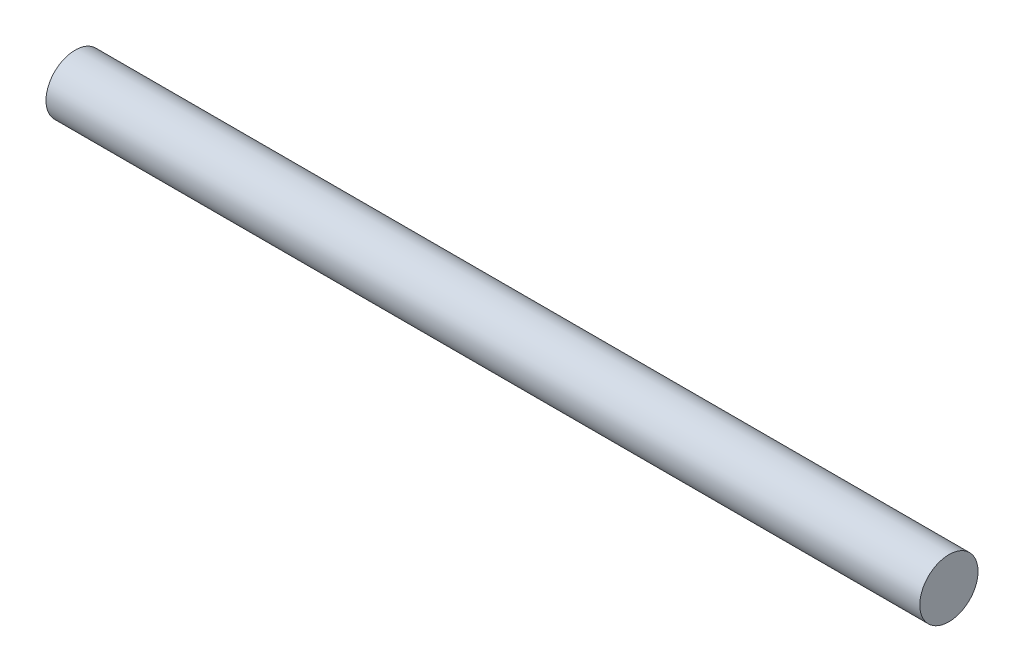
ISO-10303-21;
HEADER;
FILE_DESCRIPTION(('STEP AP214'),'2;1');
FILE_NAME('part.step','',(''),(''),'','','');
FILE_SCHEMA(('AUTOMOTIVE_DESIGN { 1 0 10303 214 1 1 1 1 }'));
ENDSEC;
DATA;
#1=APPLICATION_CONTEXT('core data for automotive mechanical design processes');
#2=APPLICATION_PROTOCOL_DEFINITION('international standard','automotive_design',2000,#1);
#3=PRODUCT_CONTEXT('',#1,'mechanical');
#4=PRODUCT('Part','Part','',(#3));
#5=PRODUCT_RELATED_PRODUCT_CATEGORY('part','',(#4));
#6=PRODUCT_DEFINITION_FORMATION('','',#4);
#7=PRODUCT_DEFINITION_CONTEXT('part definition',#1,'design');
#8=PRODUCT_DEFINITION('design','',#6,#7);
#9=PRODUCT_DEFINITION_SHAPE('','',#8);
#10=(LENGTH_UNIT() NAMED_UNIT(*) SI_UNIT(.MILLI.,.METRE.));
#11=(NAMED_UNIT(*) PLANE_ANGLE_UNIT() SI_UNIT($,.RADIAN.));
#12=(NAMED_UNIT(*) SI_UNIT($,.STERADIAN.) SOLID_ANGLE_UNIT());
#13=UNCERTAINTY_MEASURE_WITH_UNIT(LENGTH_MEASURE(1.E-05),#10,'distance_accuracy_value','');
#14=(GEOMETRIC_REPRESENTATION_CONTEXT(3) GLOBAL_UNCERTAINTY_ASSIGNED_CONTEXT((#13)) GLOBAL_UNIT_ASSIGNED_CONTEXT((#10,
#11,#12)) REPRESENTATION_CONTEXT('',''));
#15=CARTESIAN_POINT('',(0.,0.,0.));
#16=DIRECTION('',(0.,0.,1.));
#17=DIRECTION('',(1.,0.,0.));
#18=AXIS2_PLACEMENT_3D('',#15,#16,#17);
#19=CARTESIAN_POINT('',(0.,0.,0.));
#20=DIRECTION('',(1.,0.,0.));
#21=DIRECTION('',(0.,0.,-1.));
#22=AXIS2_PLACEMENT_3D('',#19,#20,#21);
#23=PLANE('',#22);
#24=CARTESIAN_POINT('',(0.,0.,0.));
#25=DIRECTION('',(-1.,0.,0.));
#26=DIRECTION('',(0.,0.,1.));
#27=AXIS2_PLACEMENT_3D('',#24,#25,#26);
#28=CIRCLE('',#27,1.5);
#29=CARTESIAN_POINT('',(0.,0.,1.5));
#30=VERTEX_POINT('',#29);
#31=EDGE_CURVE('E10',#30,#30,#28,.T.);
#32=ORIENTED_EDGE('',*,*,#31,.T.);
#33=EDGE_LOOP('',(#32));
#34=FACE_BOUND('',#33,.T.);
#35=ADVANCED_FACE('F30',(#34),#23,.F.);
#36=CARTESIAN_POINT('',(0.,0.,0.));
#37=DIRECTION('',(-1.,0.,0.));
#38=DIRECTION('',(0.,0.,1.));
#39=AXIS2_PLACEMENT_3D('',#36,#37,#38);
#40=CYLINDRICAL_SURFACE('',#39,1.50000000000001);
#41=ORIENTED_EDGE('',*,*,#31,.F.);
#42=EDGE_LOOP('',(#41));
#43=FACE_BOUND('',#42,.T.);
#44=CARTESIAN_POINT('',(45.,0.,0.));
#45=DIRECTION('',(-1.,0.,0.));
#46=DIRECTION('',(0.,0.,1.));
#47=AXIS2_PLACEMENT_3D('',#44,#45,#46);
#48=CIRCLE('',#47,1.50000000000003);
#49=CARTESIAN_POINT('',(45.,0.,1.50000000000003));
#50=VERTEX_POINT('',#49);
#51=EDGE_CURVE('E36',#50,#50,#48,.T.);
#52=ORIENTED_EDGE('',*,*,#51,.T.);
#53=EDGE_LOOP('',(#52));
#54=FACE_BOUND('',#53,.T.);
#55=ADVANCED_FACE('F42',(#43,#54),#40,.T.);
#56=CARTESIAN_POINT('',(45.,1.50000000000003,0.));
#57=DIRECTION('',(-1.,0.,0.));
#58=DIRECTION('',(0.,0.,1.));
#59=AXIS2_PLACEMENT_3D('',#56,#57,#58);
#60=PLANE('',#59);
#61=ORIENTED_EDGE('',*,*,#51,.F.);
#62=EDGE_LOOP('',(#61));
#63=FACE_BOUND('',#62,.T.);
#64=ADVANCED_FACE('F44',(#63),#60,.F.);
#65=CLOSED_SHELL('',(#35,#55,#64));
#66=MANIFOLD_SOLID_BREP('B2',#65);
#67=ADVANCED_BREP_SHAPE_REPRESENTATION('',(#18,#66),#14);
#68=SHAPE_DEFINITION_REPRESENTATION(#9,#67);
ENDSEC;
END-ISO-10303-21;
